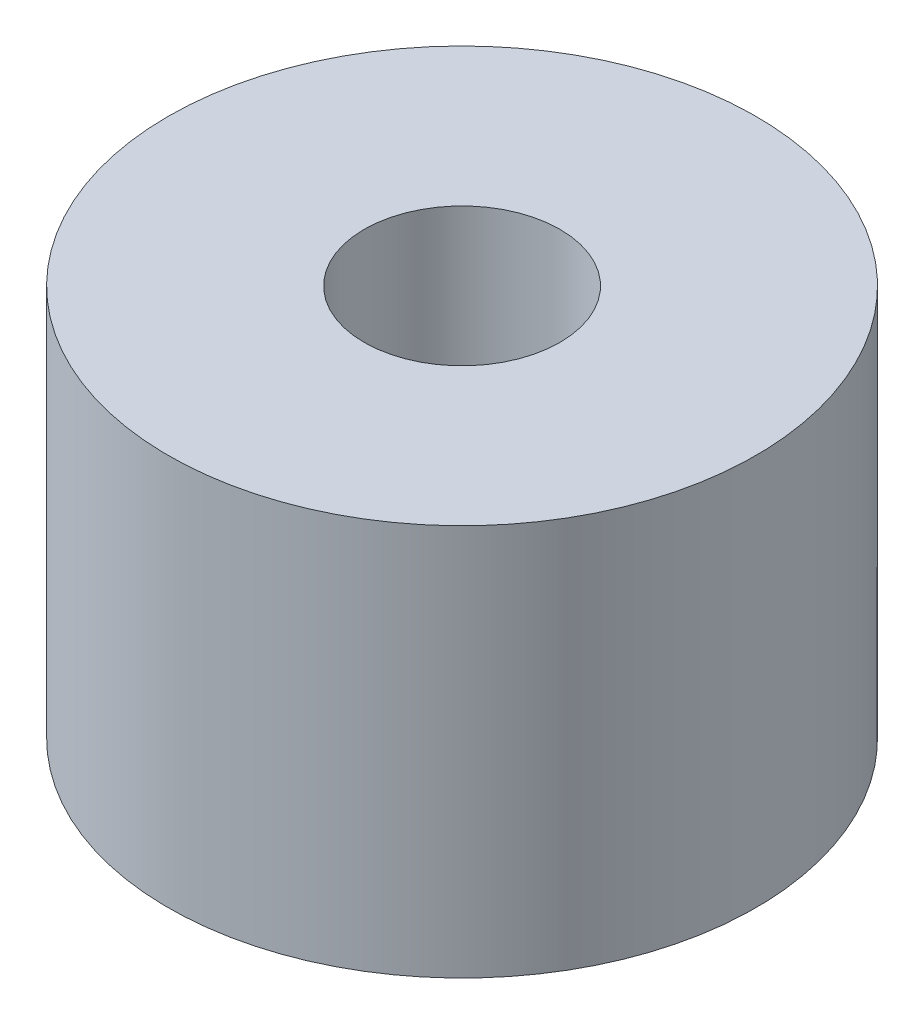
ISO-10303-21;
HEADER;
FILE_DESCRIPTION(('STEP AP214'),'2;1');
FILE_NAME('part.step','',(''),(''),'','','');
FILE_SCHEMA(('AUTOMOTIVE_DESIGN { 1 0 10303 214 1 1 1 1 }'));
ENDSEC;
DATA;
#1=APPLICATION_CONTEXT('core data for automotive mechanical design processes');
#2=APPLICATION_PROTOCOL_DEFINITION('international standard','automotive_design',2000,#1);
#3=PRODUCT_CONTEXT('',#1,'mechanical');
#4=PRODUCT('Part','Part','',(#3));
#5=PRODUCT_RELATED_PRODUCT_CATEGORY('part','',(#4));
#6=PRODUCT_DEFINITION_FORMATION('','',#4);
#7=PRODUCT_DEFINITION_CONTEXT('part definition',#1,'design');
#8=PRODUCT_DEFINITION('design','',#6,#7);
#9=PRODUCT_DEFINITION_SHAPE('','',#8);
#10=(LENGTH_UNIT() NAMED_UNIT(*) SI_UNIT(.MILLI.,.METRE.));
#11=(NAMED_UNIT(*) PLANE_ANGLE_UNIT() SI_UNIT($,.RADIAN.));
#12=(NAMED_UNIT(*) SI_UNIT($,.STERADIAN.) SOLID_ANGLE_UNIT());
#13=UNCERTAINTY_MEASURE_WITH_UNIT(LENGTH_MEASURE(1.E-05),#10,'distance_accuracy_value','');
#14=(GEOMETRIC_REPRESENTATION_CONTEXT(3) GLOBAL_UNCERTAINTY_ASSIGNED_CONTEXT((#13)) GLOBAL_UNIT_ASSIGNED_CONTEXT((#10,
#11,#12)) REPRESENTATION_CONTEXT('',''));
#15=CARTESIAN_POINT('',(0.,0.,0.));
#16=DIRECTION('',(0.,0.,1.));
#17=DIRECTION('',(1.,0.,0.));
#18=AXIS2_PLACEMENT_3D('',#15,#16,#17);
#19=CARTESIAN_POINT('',(0.,0.,0.));
#20=DIRECTION('',(0.,1.,0.));
#21=DIRECTION('',(1.,0.,0.));
#22=AXIS2_PLACEMENT_3D('',#19,#20,#21);
#23=PLANE('',#22);
#24=CARTESIAN_POINT('',(0.,0.,0.));
#25=DIRECTION('',(0.,-1.,0.));
#26=DIRECTION('',(1.,0.,0.));
#27=AXIS2_PLACEMENT_3D('',#24,#25,#26);
#28=CIRCLE('',#27,2.00000002980232);
#29=CARTESIAN_POINT('',(-2.00000002980232,0.,0.));
#30=VERTEX_POINT('',#29);
#31=EDGE_CURVE('E46',#30,#30,#28,.T.);
#32=ORIENTED_EDGE('',*,*,#31,.F.);
#33=EDGE_LOOP('',(#32));
#34=FACE_BOUND('',#33,.T.);
#35=CARTESIAN_POINT('',(0.,0.,0.));
#36=DIRECTION('',(0.,1.,0.));
#37=DIRECTION('',(1.,0.,0.));
#38=AXIS2_PLACEMENT_3D('',#35,#36,#37);
#39=CIRCLE('',#38,6.);
#40=CARTESIAN_POINT('',(-6.,0.,0.));
#41=VERTEX_POINT('',#40);
#42=EDGE_CURVE('E10',#41,#41,#39,.T.);
#43=ORIENTED_EDGE('',*,*,#42,.F.);
#44=EDGE_LOOP('',(#43));
#45=FACE_BOUND('',#44,.T.);
#46=ADVANCED_FACE('F15',(#34,#45),#23,.F.);
#47=CARTESIAN_POINT('',(0.,0.,0.));
#48=DIRECTION('',(0.,1.,0.));
#49=DIRECTION('',(1.,0.,0.));
#50=AXIS2_PLACEMENT_3D('',#47,#48,#49);
#51=CYLINDRICAL_SURFACE('',#50,6.);
#52=CARTESIAN_POINT('',(0.,8.,0.));
#53=DIRECTION('',(0.,-1.,0.));
#54=DIRECTION('',(1.,0.,0.));
#55=AXIS2_PLACEMENT_3D('',#52,#53,#54);
#56=CIRCLE('',#55,6.);
#57=CARTESIAN_POINT('',(-6.,8.,0.));
#58=VERTEX_POINT('',#57);
#59=EDGE_CURVE('E19',#58,#58,#56,.T.);
#60=ORIENTED_EDGE('',*,*,#59,.T.);
#61=DIRECTION('',(0.,-1.,0.));
#62=VECTOR('',#61,1.);
#63=CARTESIAN_POINT('',(-6.,0.,0.));
#64=LINE('',#63,#62);
#65=EDGE_CURVE('E25',#58,#41,#64,.T.);
#66=ORIENTED_EDGE('',*,*,#65,.T.);
#67=ORIENTED_EDGE('',*,*,#42,.T.);
#68=ORIENTED_EDGE('',*,*,#65,.F.);
#69=EDGE_LOOP('',(#60,#66,#67,#68));
#70=FACE_BOUND('',#69,.T.);
#71=ADVANCED_FACE('F52',(#70),#51,.T.);
#72=CARTESIAN_POINT('',(0.,0.,0.));
#73=DIRECTION('',(0.,1.,0.));
#74=DIRECTION('',(1.,0.,0.));
#75=AXIS2_PLACEMENT_3D('',#72,#73,#74);
#76=CYLINDRICAL_SURFACE('',#75,2.00000002980232);
#77=CARTESIAN_POINT('',(0.,8.,0.));
#78=DIRECTION('',(0.,1.,0.));
#79=DIRECTION('',(1.,0.,0.));
#80=AXIS2_PLACEMENT_3D('',#77,#78,#79);
#81=CIRCLE('',#80,2.00000002980232);
#82=CARTESIAN_POINT('',(-2.00000002980232,8.,0.));
#83=VERTEX_POINT('',#82);
#84=EDGE_CURVE('E64',#83,#83,#81,.T.);
#85=ORIENTED_EDGE('',*,*,#84,.T.);
#86=DIRECTION('',(0.,-1.,0.));
#87=VECTOR('',#86,1.);
#88=CARTESIAN_POINT('',(-2.00000002980232,0.,0.));
#89=LINE('',#88,#87);
#90=EDGE_CURVE('E60',#83,#30,#89,.T.);
#91=ORIENTED_EDGE('',*,*,#90,.T.);
#92=ORIENTED_EDGE('',*,*,#31,.T.);
#93=ORIENTED_EDGE('',*,*,#90,.F.);
#94=EDGE_LOOP('',(#85,#91,#92,#93));
#95=FACE_BOUND('',#94,.T.);
#96=ADVANCED_FACE('F97',(#95),#76,.F.);
#97=CARTESIAN_POINT('',(0.,8.,0.));
#98=DIRECTION('',(0.,1.,0.));
#99=DIRECTION('',(1.,0.,0.));
#100=AXIS2_PLACEMENT_3D('',#97,#98,#99);
#101=PLANE('',#100);
#102=ORIENTED_EDGE('',*,*,#84,.F.);
#103=EDGE_LOOP('',(#102));
#104=FACE_BOUND('',#103,.T.);
#105=ORIENTED_EDGE('',*,*,#59,.F.);
#106=EDGE_LOOP('',(#105));
#107=FACE_BOUND('',#106,.T.);
#108=ADVANCED_FACE('F17',(#104,#107),#101,.T.);
#109=CLOSED_SHELL('',(#46,#71,#96,#108));
#110=MANIFOLD_SOLID_BREP('B1',#109);
#111=ADVANCED_BREP_SHAPE_REPRESENTATION('',(#18,#110),#14);
#112=SHAPE_DEFINITION_REPRESENTATION(#9,#111);
ENDSEC;
END-ISO-10303-21;
